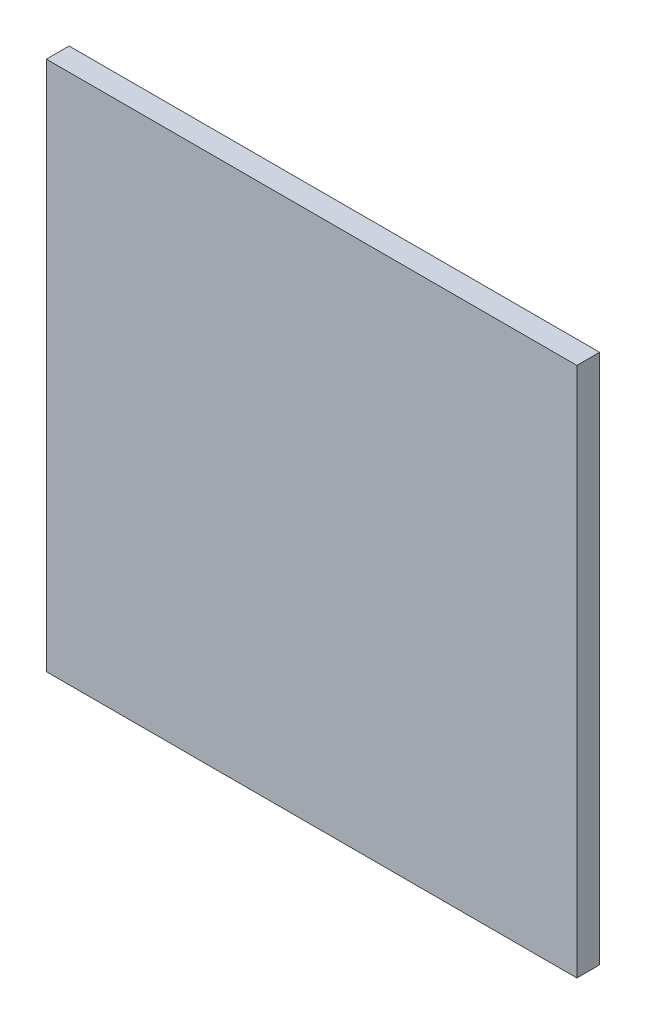
ISO-10303-21;
HEADER;
FILE_DESCRIPTION(('STEP AP214'),'2;1');
FILE_NAME('part.step','',(''),(''),'','','');
FILE_SCHEMA(('AUTOMOTIVE_DESIGN { 1 0 10303 214 1 1 1 1 }'));
ENDSEC;
DATA;
#1=APPLICATION_CONTEXT('core data for automotive mechanical design processes');
#2=APPLICATION_PROTOCOL_DEFINITION('international standard','automotive_design',2000,#1);
#3=PRODUCT_CONTEXT('',#1,'mechanical');
#4=PRODUCT('Part','Part','',(#3));
#5=PRODUCT_RELATED_PRODUCT_CATEGORY('part','',(#4));
#6=PRODUCT_DEFINITION_FORMATION('','',#4);
#7=PRODUCT_DEFINITION_CONTEXT('part definition',#1,'design');
#8=PRODUCT_DEFINITION('design','',#6,#7);
#9=PRODUCT_DEFINITION_SHAPE('','',#8);
#10=(LENGTH_UNIT() NAMED_UNIT(*) SI_UNIT(.MILLI.,.METRE.));
#11=(NAMED_UNIT(*) PLANE_ANGLE_UNIT() SI_UNIT($,.RADIAN.));
#12=(NAMED_UNIT(*) SI_UNIT($,.STERADIAN.) SOLID_ANGLE_UNIT());
#13=UNCERTAINTY_MEASURE_WITH_UNIT(LENGTH_MEASURE(1.E-05),#10,'distance_accuracy_value','');
#14=(GEOMETRIC_REPRESENTATION_CONTEXT(3) GLOBAL_UNCERTAINTY_ASSIGNED_CONTEXT((#13)) GLOBAL_UNIT_ASSIGNED_CONTEXT((#10,
#11,#12)) REPRESENTATION_CONTEXT('',''));
#15=CARTESIAN_POINT('',(0.,0.,0.));
#16=DIRECTION('',(0.,0.,1.));
#17=DIRECTION('',(1.,0.,0.));
#18=AXIS2_PLACEMENT_3D('',#15,#16,#17);
#19=CARTESIAN_POINT('',(12.55008,0.65,0.));
#20=DIRECTION('',(0.,0.,-1.));
#21=DIRECTION('',(-1.,0.,0.));
#22=AXIS2_PLACEMENT_3D('',#19,#20,#21);
#23=PLANE('',#22);
#24=DIRECTION('',(1.,0.,0.));
#25=VECTOR('',#24,1.);
#26=CARTESIAN_POINT('',(12.15008,1.05,0.));
#27=LINE('',#26,#25);
#28=CARTESIAN_POINT('',(12.15008,1.05,0.));
#29=VERTEX_POINT('',#28);
#30=CARTESIAN_POINT('',(12.95008,1.05,0.));
#31=VERTEX_POINT('',#30);
#32=EDGE_CURVE('E55',#29,#31,#27,.T.);
#33=ORIENTED_EDGE('',*,*,#32,.T.);
#34=DIRECTION('',(0.,1.,0.));
#35=VECTOR('',#34,1.);
#36=CARTESIAN_POINT('',(12.95008,1.05,0.));
#37=LINE('',#36,#35);
#38=CARTESIAN_POINT('',(12.95008,0.25,0.));
#39=VERTEX_POINT('',#38);
#40=EDGE_CURVE('E57',#31,#39,#37,.F.);
#41=ORIENTED_EDGE('',*,*,#40,.T.);
#42=DIRECTION('',(1.,0.,0.));
#43=VECTOR('',#42,1.);
#44=CARTESIAN_POINT('',(12.95008,0.25,0.));
#45=LINE('',#44,#43);
#46=CARTESIAN_POINT('',(12.15008,0.25,0.));
#47=VERTEX_POINT('',#46);
#48=EDGE_CURVE('E20',#39,#47,#45,.F.);
#49=ORIENTED_EDGE('',*,*,#48,.T.);
#50=DIRECTION('',(0.,1.,0.));
#51=VECTOR('',#50,1.);
#52=CARTESIAN_POINT('',(12.15008,0.25,0.));
#53=LINE('',#52,#51);
#54=EDGE_CURVE('E80',#47,#29,#53,.T.);
#55=ORIENTED_EDGE('',*,*,#54,.T.);
#56=EDGE_LOOP('',(#33,#41,#49,#55));
#57=FACE_BOUND('',#56,.T.);
#58=ADVANCED_FACE('F17',(#57),#23,.T.);
#59=CARTESIAN_POINT('',(12.95008,0.25,0.));
#60=DIRECTION('',(0.,1.,0.));
#61=DIRECTION('',(0.,0.,1.));
#62=AXIS2_PLACEMENT_3D('',#59,#60,#61);
#63=PLANE('',#62);
#64=DIRECTION('',(0.,0.,-1.));
#65=VECTOR('',#64,1.);
#66=CARTESIAN_POINT('',(12.15008,0.25,0.));
#67=LINE('',#66,#65);
#68=CARTESIAN_POINT('',(12.15008,0.25,0.03429));
#69=VERTEX_POINT('',#68);
#70=EDGE_CURVE('E68',#69,#47,#67,.T.);
#71=ORIENTED_EDGE('',*,*,#70,.T.);
#72=ORIENTED_EDGE('',*,*,#48,.F.);
#73=DIRECTION('',(0.,0.,1.));
#74=VECTOR('',#73,1.);
#75=CARTESIAN_POINT('',(12.95008,0.25,0.));
#76=LINE('',#75,#74);
#77=CARTESIAN_POINT('',(12.95008,0.25,0.03429));
#78=VERTEX_POINT('',#77);
#79=EDGE_CURVE('E63',#39,#78,#76,.T.);
#80=ORIENTED_EDGE('',*,*,#79,.T.);
#81=DIRECTION('',(1.,0.,0.));
#82=VECTOR('',#81,1.);
#83=CARTESIAN_POINT('',(12.55008,0.25,0.03429));
#84=LINE('',#83,#82);
#85=EDGE_CURVE('E83',#69,#78,#84,.T.);
#86=ORIENTED_EDGE('',*,*,#85,.F.);
#87=EDGE_LOOP('',(#71,#72,#80,#86));
#88=FACE_BOUND('',#87,.T.);
#89=ADVANCED_FACE('F65',(#88),#63,.F.);
#90=CARTESIAN_POINT('',(12.95008,1.05,0.));
#91=DIRECTION('',(-1.,0.,0.));
#92=DIRECTION('',(0.,0.,1.));
#93=AXIS2_PLACEMENT_3D('',#90,#91,#92);
#94=PLANE('',#93);
#95=ORIENTED_EDGE('',*,*,#79,.F.);
#96=ORIENTED_EDGE('',*,*,#40,.F.);
#97=DIRECTION('',(0.,0.,-1.));
#98=VECTOR('',#97,1.);
#99=CARTESIAN_POINT('',(12.95008,1.05,0.));
#100=LINE('',#99,#98);
#101=CARTESIAN_POINT('',(12.95008,1.05,0.03429));
#102=VERTEX_POINT('',#101);
#103=EDGE_CURVE('E75',#31,#102,#100,.F.);
#104=ORIENTED_EDGE('',*,*,#103,.T.);
#105=DIRECTION('',(0.,1.,0.));
#106=VECTOR('',#105,1.);
#107=CARTESIAN_POINT('',(12.95008,0.65,0.03429));
#108=LINE('',#107,#106);
#109=EDGE_CURVE('E72',#78,#102,#108,.T.);
#110=ORIENTED_EDGE('',*,*,#109,.F.);
#111=EDGE_LOOP('',(#95,#96,#104,#110));
#112=FACE_BOUND('',#111,.T.);
#113=ADVANCED_FACE('F70',(#112),#94,.F.);
#114=CARTESIAN_POINT('',(12.15008,1.05,0.));
#115=DIRECTION('',(0.,-1.,0.));
#116=DIRECTION('',(0.,0.,-1.));
#117=AXIS2_PLACEMENT_3D('',#114,#115,#116);
#118=PLANE('',#117);
#119=ORIENTED_EDGE('',*,*,#103,.F.);
#120=ORIENTED_EDGE('',*,*,#32,.F.);
#121=DIRECTION('',(0.,0.,-1.));
#122=VECTOR('',#121,1.);
#123=CARTESIAN_POINT('',(12.15008,1.05,0.));
#124=LINE('',#123,#122);
#125=CARTESIAN_POINT('',(12.15008,1.05,0.03429));
#126=VERTEX_POINT('',#125);
#127=EDGE_CURVE('E35',#29,#126,#124,.F.);
#128=ORIENTED_EDGE('',*,*,#127,.T.);
#129=DIRECTION('',(1.,0.,0.));
#130=VECTOR('',#129,1.);
#131=CARTESIAN_POINT('',(12.55008,1.05,0.03429));
#132=LINE('',#131,#130);
#133=EDGE_CURVE('E26',#102,#126,#132,.F.);
#134=ORIENTED_EDGE('',*,*,#133,.F.);
#135=EDGE_LOOP('',(#119,#120,#128,#134));
#136=FACE_BOUND('',#135,.T.);
#137=ADVANCED_FACE('F89',(#136),#118,.F.);
#138=CARTESIAN_POINT('',(12.15008,0.25,0.));
#139=DIRECTION('',(1.,0.,0.));
#140=DIRECTION('',(0.,0.,-1.));
#141=AXIS2_PLACEMENT_3D('',#138,#139,#140);
#142=PLANE('',#141);
#143=ORIENTED_EDGE('',*,*,#127,.F.);
#144=ORIENTED_EDGE('',*,*,#54,.F.);
#145=ORIENTED_EDGE('',*,*,#70,.F.);
#146=DIRECTION('',(0.,1.,0.));
#147=VECTOR('',#146,1.);
#148=CARTESIAN_POINT('',(12.15008,0.65,0.03429));
#149=LINE('',#148,#147);
#150=EDGE_CURVE('E11',#126,#69,#149,.F.);
#151=ORIENTED_EDGE('',*,*,#150,.F.);
#152=EDGE_LOOP('',(#143,#144,#145,#151));
#153=FACE_BOUND('',#152,.T.);
#154=ADVANCED_FACE('F91',(#153),#142,.F.);
#155=CARTESIAN_POINT('',(12.55008,0.65,0.03429));
#156=DIRECTION('',(0.,0.,1.));
#157=DIRECTION('',(1.,0.,0.));
#158=AXIS2_PLACEMENT_3D('',#155,#156,#157);
#159=PLANE('',#158);
#160=ORIENTED_EDGE('',*,*,#133,.T.);
#161=ORIENTED_EDGE('',*,*,#150,.T.);
#162=ORIENTED_EDGE('',*,*,#85,.T.);
#163=ORIENTED_EDGE('',*,*,#109,.T.);
#164=EDGE_LOOP('',(#160,#161,#162,#163));
#165=FACE_BOUND('',#164,.T.);
#166=ADVANCED_FACE('F88',(#165),#159,.T.);
#167=CLOSED_SHELL('',(#58,#89,#113,#137,#154,#166));
#168=MANIFOLD_SOLID_BREP('B1',#167);
#169=ADVANCED_BREP_SHAPE_REPRESENTATION('',(#18,#168),#14);
#170=SHAPE_DEFINITION_REPRESENTATION(#9,#169);
ENDSEC;
END-ISO-10303-21;
